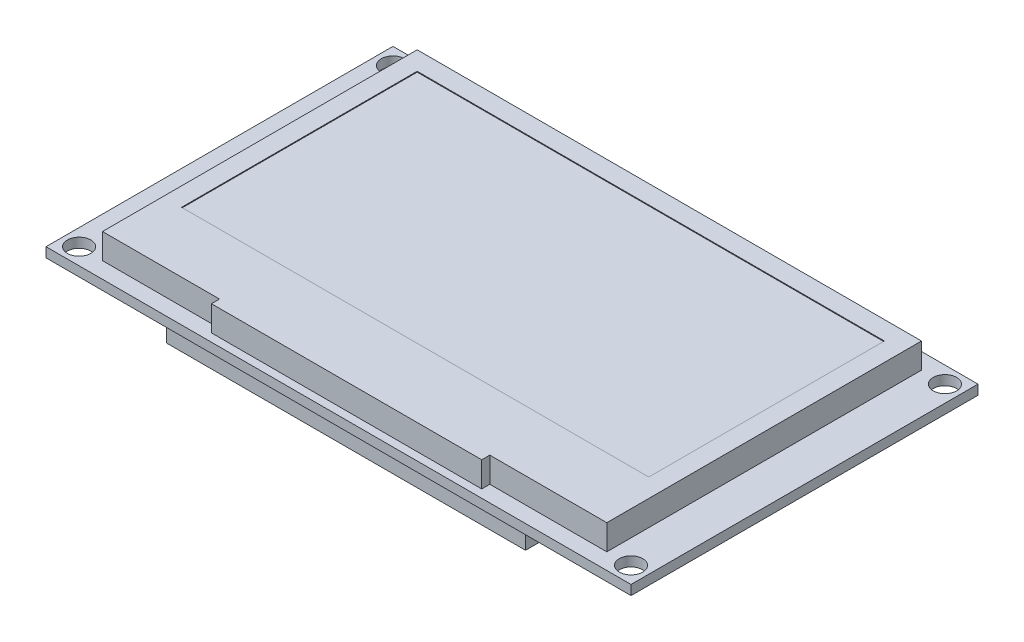
ISO-10303-21;
HEADER;
FILE_DESCRIPTION(('STEP AP214'),'2;1');
FILE_NAME('part.step','',(''),(''),'','','');
FILE_SCHEMA(('AUTOMOTIVE_DESIGN { 1 0 10303 214 1 1 1 1 }'));
ENDSEC;
DATA;
#1=APPLICATION_CONTEXT('core data for automotive mechanical design processes');
#2=APPLICATION_PROTOCOL_DEFINITION('international standard','automotive_design',2000,#1);
#3=PRODUCT_CONTEXT('',#1,'mechanical');
#4=PRODUCT('Part','Part','',(#3));
#5=PRODUCT_RELATED_PRODUCT_CATEGORY('part','',(#4));
#6=PRODUCT_DEFINITION_FORMATION('','',#4);
#7=PRODUCT_DEFINITION_CONTEXT('part definition',#1,'design');
#8=PRODUCT_DEFINITION('design','',#6,#7);
#9=PRODUCT_DEFINITION_SHAPE('','',#8);
#10=(LENGTH_UNIT() NAMED_UNIT(*) SI_UNIT(.MILLI.,.METRE.));
#11=(NAMED_UNIT(*) PLANE_ANGLE_UNIT() SI_UNIT($,.RADIAN.));
#12=(NAMED_UNIT(*) SI_UNIT($,.STERADIAN.) SOLID_ANGLE_UNIT());
#13=UNCERTAINTY_MEASURE_WITH_UNIT(LENGTH_MEASURE(1.E-05),#10,'distance_accuracy_value','');
#14=(GEOMETRIC_REPRESENTATION_CONTEXT(3) GLOBAL_UNCERTAINTY_ASSIGNED_CONTEXT((#13)) GLOBAL_UNIT_ASSIGNED_CONTEXT((#10,
#11,#12)) REPRESENTATION_CONTEXT('',''));
#15=CARTESIAN_POINT('',(0.,0.,0.));
#16=DIRECTION('',(0.,0.,1.));
#17=DIRECTION('',(1.,0.,0.));
#18=AXIS2_PLACEMENT_3D('',#15,#16,#17);
#19=CARTESIAN_POINT('',(0.,0.,0.));
#20=DIRECTION('',(0.,-1.,0.));
#21=DIRECTION('',(0.,0.,-1.));
#22=AXIS2_PLACEMENT_3D('',#19,#20,#21);
#23=PLANE('',#22);
#24=DIRECTION('',(0.,0.,-1.));
#25=VECTOR('',#24,1.);
#26=CARTESIAN_POINT('',(36.25,0.,21.5));
#27=LINE('',#26,#25);
#28=CARTESIAN_POINT('',(36.25,0.,21.5));
#29=VERTEX_POINT('',#28);
#30=CARTESIAN_POINT('',(36.25,0.,-21.5));
#31=VERTEX_POINT('',#30);
#32=EDGE_CURVE('E366',#29,#31,#27,.T.);
#33=ORIENTED_EDGE('',*,*,#32,.T.);
#34=DIRECTION('',(-1.,0.,0.));
#35=VECTOR('',#34,1.);
#36=CARTESIAN_POINT('',(-36.25,0.,-21.5));
#37=LINE('',#36,#35);
#38=CARTESIAN_POINT('',(-36.25,0.,-21.5));
#39=VERTEX_POINT('',#38);
#40=EDGE_CURVE('E384',#31,#39,#37,.T.);
#41=ORIENTED_EDGE('',*,*,#40,.T.);
#42=DIRECTION('',(0.,0.,1.));
#43=VECTOR('',#42,1.);
#44=CARTESIAN_POINT('',(-36.25,0.,21.5));
#45=LINE('',#44,#43);
#46=CARTESIAN_POINT('',(-36.25,0.,21.5));
#47=VERTEX_POINT('',#46);
#48=EDGE_CURVE('E387',#39,#47,#45,.T.);
#49=ORIENTED_EDGE('',*,*,#48,.T.);
#50=DIRECTION('',(1.,0.,0.));
#51=VECTOR('',#50,1.);
#52=CARTESIAN_POINT('',(-36.25,0.,21.5));
#53=LINE('',#52,#51);
#54=EDGE_CURVE('E373',#47,#29,#53,.T.);
#55=ORIENTED_EDGE('',*,*,#54,.T.);
#56=EDGE_LOOP('',(#33,#41,#49,#55));
#57=FACE_BOUND('',#56,.T.);
#58=CARTESIAN_POINT('',(-34.2,0.,-19.45));
#59=DIRECTION('',(0.,1.,0.));
#60=DIRECTION('',(0.,0.,1.));
#61=AXIS2_PLACEMENT_3D('',#58,#59,#60);
#62=CIRCLE('',#61,1.45);
#63=CARTESIAN_POINT('',(-34.2,0.,-18.));
#64=VERTEX_POINT('',#63);
#65=EDGE_CURVE('E360',#64,#64,#62,.T.);
#66=ORIENTED_EDGE('',*,*,#65,.F.);
#67=EDGE_LOOP('',(#66));
#68=FACE_BOUND('',#67,.T.);
#69=CARTESIAN_POINT('',(-33.7500000000001,0.,-7.62));
#70=DIRECTION('',(0.,1.,0.));
#71=DIRECTION('',(0.,0.,1.));
#72=AXIS2_PLACEMENT_3D('',#69,#70,#71);
#73=CIRCLE('',#72,0.499999999999999);
#74=CARTESIAN_POINT('',(-33.7500000000001,0.,-7.12));
#75=VERTEX_POINT('',#74);
#76=EDGE_CURVE('E354',#75,#75,#73,.T.);
#77=ORIENTED_EDGE('',*,*,#76,.F.);
#78=EDGE_LOOP('',(#77));
#79=FACE_BOUND('',#78,.T.);
#80=CARTESIAN_POINT('',(-33.75,0.,-5.08));
#81=DIRECTION('',(0.,1.,0.));
#82=DIRECTION('',(0.,0.,1.));
#83=AXIS2_PLACEMENT_3D('',#80,#81,#82);
#84=CIRCLE('',#83,0.499999999999999);
#85=CARTESIAN_POINT('',(-33.75,0.,-4.58));
#86=VERTEX_POINT('',#85);
#87=EDGE_CURVE('E348',#86,#86,#84,.T.);
#88=ORIENTED_EDGE('',*,*,#87,.F.);
#89=EDGE_LOOP('',(#88));
#90=FACE_BOUND('',#89,.T.);
#91=CARTESIAN_POINT('',(-33.75,0.,-2.54));
#92=DIRECTION('',(0.,1.,0.));
#93=DIRECTION('',(0.,0.,1.));
#94=AXIS2_PLACEMENT_3D('',#91,#92,#93);
#95=CIRCLE('',#94,0.499999999999999);
#96=CARTESIAN_POINT('',(-33.75,0.,-2.04));
#97=VERTEX_POINT('',#96);
#98=EDGE_CURVE('E342',#97,#97,#95,.T.);
#99=ORIENTED_EDGE('',*,*,#98,.F.);
#100=EDGE_LOOP('',(#99));
#101=FACE_BOUND('',#100,.T.);
#102=CARTESIAN_POINT('',(-33.75,0.,0.));
#103=DIRECTION('',(0.,1.,0.));
#104=DIRECTION('',(0.,0.,1.));
#105=AXIS2_PLACEMENT_3D('',#102,#103,#104);
#106=CIRCLE('',#105,0.499999999999999);
#107=CARTESIAN_POINT('',(-33.75,0.,0.499999999999999));
#108=VERTEX_POINT('',#107);
#109=EDGE_CURVE('E336',#108,#108,#106,.T.);
#110=ORIENTED_EDGE('',*,*,#109,.F.);
#111=EDGE_LOOP('',(#110));
#112=FACE_BOUND('',#111,.T.);
#113=CARTESIAN_POINT('',(-33.75,0.,2.54));
#114=DIRECTION('',(0.,1.,0.));
#115=DIRECTION('',(0.,0.,1.));
#116=AXIS2_PLACEMENT_3D('',#113,#114,#115);
#117=CIRCLE('',#116,0.499999999999999);
#118=CARTESIAN_POINT('',(-33.75,0.,3.04));
#119=VERTEX_POINT('',#118);
#120=EDGE_CURVE('E330',#119,#119,#117,.T.);
#121=ORIENTED_EDGE('',*,*,#120,.F.);
#122=EDGE_LOOP('',(#121));
#123=FACE_BOUND('',#122,.T.);
#124=CARTESIAN_POINT('',(-33.7499999999999,0.,5.08));
#125=DIRECTION('',(0.,1.,0.));
#126=DIRECTION('',(0.,0.,1.));
#127=AXIS2_PLACEMENT_3D('',#124,#125,#126);
#128=CIRCLE('',#127,0.499999999999999);
#129=CARTESIAN_POINT('',(-33.7499999999999,0.,5.58));
#130=VERTEX_POINT('',#129);
#131=EDGE_CURVE('E324',#130,#130,#128,.T.);
#132=ORIENTED_EDGE('',*,*,#131,.F.);
#133=EDGE_LOOP('',(#132));
#134=FACE_BOUND('',#133,.T.);
#135=CARTESIAN_POINT('',(-33.7499999999999,0.,7.62));
#136=DIRECTION('',(0.,1.,0.));
#137=DIRECTION('',(0.,0.,1.));
#138=AXIS2_PLACEMENT_3D('',#135,#136,#137);
#139=CIRCLE('',#138,0.499999999999999);
#140=CARTESIAN_POINT('',(-33.7499999999999,0.,8.12));
#141=VERTEX_POINT('',#140);
#142=EDGE_CURVE('E318',#141,#141,#139,.T.);
#143=ORIENTED_EDGE('',*,*,#142,.F.);
#144=EDGE_LOOP('',(#143));
#145=FACE_BOUND('',#144,.T.);
#146=CARTESIAN_POINT('',(-34.2,0.,19.45));
#147=DIRECTION('',(0.,1.,0.));
#148=DIRECTION('',(0.,0.,-1.));
#149=AXIS2_PLACEMENT_3D('',#146,#147,#148);
#150=CIRCLE('',#149,1.45);
#151=CARTESIAN_POINT('',(-34.2,0.,18.));
#152=VERTEX_POINT('',#151);
#153=EDGE_CURVE('E312',#152,#152,#150,.T.);
#154=ORIENTED_EDGE('',*,*,#153,.F.);
#155=EDGE_LOOP('',(#154));
#156=FACE_BOUND('',#155,.T.);
#157=CARTESIAN_POINT('',(34.2,0.,-19.45));
#158=DIRECTION('',(0.,1.,0.));
#159=DIRECTION('',(0.,0.,-1.));
#160=AXIS2_PLACEMENT_3D('',#157,#158,#159);
#161=CIRCLE('',#160,1.45);
#162=CARTESIAN_POINT('',(34.2,0.,-20.9));
#163=VERTEX_POINT('',#162);
#164=EDGE_CURVE('E306',#163,#163,#161,.T.);
#165=ORIENTED_EDGE('',*,*,#164,.F.);
#166=EDGE_LOOP('',(#165));
#167=FACE_BOUND('',#166,.T.);
#168=CARTESIAN_POINT('',(34.2,0.,19.45));
#169=DIRECTION('',(0.,1.,0.));
#170=DIRECTION('',(0.,0.,1.));
#171=AXIS2_PLACEMENT_3D('',#168,#169,#170);
#172=CIRCLE('',#171,1.45);
#173=CARTESIAN_POINT('',(34.2,0.,20.9));
#174=VERTEX_POINT('',#173);
#175=EDGE_CURVE('E302',#174,#174,#172,.T.);
#176=ORIENTED_EDGE('',*,*,#175,.F.);
#177=EDGE_LOOP('',(#176));
#178=FACE_BOUND('',#177,.T.);
#179=DIRECTION('',(0.,0.,-1.));
#180=VECTOR('',#179,1.);
#181=CARTESIAN_POINT('',(31.25,0.,19.5));
#182=LINE('',#181,#180);
#183=CARTESIAN_POINT('',(31.25,0.,19.5));
#184=VERTEX_POINT('',#183);
#185=CARTESIAN_POINT('',(31.25,0.,-19.5));
#186=VERTEX_POINT('',#185);
#187=EDGE_CURVE('E60',#184,#186,#182,.T.);
#188=ORIENTED_EDGE('',*,*,#187,.F.);
#189=DIRECTION('',(1.,0.,0.));
#190=VECTOR('',#189,1.);
#191=CARTESIAN_POINT('',(16.75,0.,19.5));
#192=LINE('',#191,#190);
#193=CARTESIAN_POINT('',(16.75,0.,19.5));
#194=VERTEX_POINT('',#193);
#195=EDGE_CURVE('E215',#194,#184,#192,.T.);
#196=ORIENTED_EDGE('',*,*,#195,.F.);
#197=DIRECTION('',(0.,0.,-1.));
#198=VECTOR('',#197,1.);
#199=CARTESIAN_POINT('',(16.75,0.,20.5));
#200=LINE('',#199,#198);
#201=CARTESIAN_POINT('',(16.75,0.,20.5));
#202=VERTEX_POINT('',#201);
#203=EDGE_CURVE('E246',#202,#194,#200,.T.);
#204=ORIENTED_EDGE('',*,*,#203,.F.);
#205=DIRECTION('',(1.,0.,0.));
#206=VECTOR('',#205,1.);
#207=CARTESIAN_POINT('',(-16.75,0.,20.5));
#208=LINE('',#207,#206);
#209=CARTESIAN_POINT('',(-16.75,0.,20.5));
#210=VERTEX_POINT('',#209);
#211=EDGE_CURVE('E243',#210,#202,#208,.T.);
#212=ORIENTED_EDGE('',*,*,#211,.F.);
#213=DIRECTION('',(0.,0.,1.));
#214=VECTOR('',#213,1.);
#215=CARTESIAN_POINT('',(-16.75,0.,19.5));
#216=LINE('',#215,#214);
#217=CARTESIAN_POINT('',(-16.75,0.,19.5));
#218=VERTEX_POINT('',#217);
#219=EDGE_CURVE('E240',#218,#210,#216,.T.);
#220=ORIENTED_EDGE('',*,*,#219,.F.);
#221=DIRECTION('',(1.,0.,0.));
#222=VECTOR('',#221,1.);
#223=CARTESIAN_POINT('',(-31.25,0.,19.5));
#224=LINE('',#223,#222);
#225=CARTESIAN_POINT('',(-31.25,0.,19.5));
#226=VERTEX_POINT('',#225);
#227=EDGE_CURVE('E237',#226,#218,#224,.T.);
#228=ORIENTED_EDGE('',*,*,#227,.F.);
#229=DIRECTION('',(0.,0.,1.));
#230=VECTOR('',#229,1.);
#231=CARTESIAN_POINT('',(-31.25,0.,19.5));
#232=LINE('',#231,#230);
#233=CARTESIAN_POINT('',(-31.25,0.,-19.5));
#234=VERTEX_POINT('',#233);
#235=EDGE_CURVE('E234',#234,#226,#232,.T.);
#236=ORIENTED_EDGE('',*,*,#235,.F.);
#237=DIRECTION('',(-1.,0.,0.));
#238=VECTOR('',#237,1.);
#239=CARTESIAN_POINT('',(-31.25,0.,-19.5));
#240=LINE('',#239,#238);
#241=EDGE_CURVE('E231',#186,#234,#240,.T.);
#242=ORIENTED_EDGE('',*,*,#241,.F.);
#243=EDGE_LOOP('',(#188,#196,#204,#212,#220,#228,#236,#242));
#244=FACE_BOUND('',#243,.T.);
#245=ADVANCED_FACE('F35',(#57,#68,#79,#90,#101,#112,#123,#134,#145,#156,#167,#178,#244),#23,.F.);
#246=CARTESIAN_POINT('',(0.,-1.2,0.));
#247=DIRECTION('',(0.,-1.,0.));
#248=DIRECTION('',(0.,0.,-1.));
#249=AXIS2_PLACEMENT_3D('',#246,#247,#248);
#250=PLANE('',#249);
#251=CARTESIAN_POINT('',(34.2,-1.2,19.45));
#252=DIRECTION('',(0.,1.,0.));
#253=DIRECTION('',(0.,0.,1.));
#254=AXIS2_PLACEMENT_3D('',#251,#252,#253);
#255=CIRCLE('',#254,1.45);
#256=CARTESIAN_POINT('',(34.2,-1.2,20.9));
#257=VERTEX_POINT('',#256);
#258=EDGE_CURVE('E303',#257,#257,#255,.T.);
#259=ORIENTED_EDGE('',*,*,#258,.T.);
#260=EDGE_LOOP('',(#259));
#261=FACE_BOUND('',#260,.T.);
#262=CARTESIAN_POINT('',(34.2,-1.2,-19.45));
#263=DIRECTION('',(0.,1.,0.));
#264=DIRECTION('',(0.,0.,-1.));
#265=AXIS2_PLACEMENT_3D('',#262,#263,#264);
#266=CIRCLE('',#265,1.45);
#267=CARTESIAN_POINT('',(34.2,-1.2,-20.9));
#268=VERTEX_POINT('',#267);
#269=EDGE_CURVE('E309',#268,#268,#266,.T.);
#270=ORIENTED_EDGE('',*,*,#269,.T.);
#271=EDGE_LOOP('',(#270));
#272=FACE_BOUND('',#271,.T.);
#273=CARTESIAN_POINT('',(-34.2,-1.2,19.45));
#274=DIRECTION('',(0.,1.,0.));
#275=DIRECTION('',(0.,0.,-1.));
#276=AXIS2_PLACEMENT_3D('',#273,#274,#275);
#277=CIRCLE('',#276,1.45);
#278=CARTESIAN_POINT('',(-34.2,-1.2,18.));
#279=VERTEX_POINT('',#278);
#280=EDGE_CURVE('E315',#279,#279,#277,.T.);
#281=ORIENTED_EDGE('',*,*,#280,.T.);
#282=EDGE_LOOP('',(#281));
#283=FACE_BOUND('',#282,.T.);
#284=CARTESIAN_POINT('',(-33.7499999999999,-1.2,7.62));
#285=DIRECTION('',(0.,1.,0.));
#286=DIRECTION('',(0.,0.,1.));
#287=AXIS2_PLACEMENT_3D('',#284,#285,#286);
#288=CIRCLE('',#287,0.499999999999999);
#289=CARTESIAN_POINT('',(-33.7499999999999,-1.2,8.12));
#290=VERTEX_POINT('',#289);
#291=EDGE_CURVE('E321',#290,#290,#288,.T.);
#292=ORIENTED_EDGE('',*,*,#291,.T.);
#293=EDGE_LOOP('',(#292));
#294=FACE_BOUND('',#293,.T.);
#295=CARTESIAN_POINT('',(-33.7499999999999,-1.2,5.08));
#296=DIRECTION('',(0.,1.,0.));
#297=DIRECTION('',(0.,0.,1.));
#298=AXIS2_PLACEMENT_3D('',#295,#296,#297);
#299=CIRCLE('',#298,0.499999999999999);
#300=CARTESIAN_POINT('',(-33.7499999999999,-1.2,5.58));
#301=VERTEX_POINT('',#300);
#302=EDGE_CURVE('E327',#301,#301,#299,.T.);
#303=ORIENTED_EDGE('',*,*,#302,.T.);
#304=EDGE_LOOP('',(#303));
#305=FACE_BOUND('',#304,.T.);
#306=CARTESIAN_POINT('',(-33.75,-1.2,2.54));
#307=DIRECTION('',(0.,1.,0.));
#308=DIRECTION('',(0.,0.,1.));
#309=AXIS2_PLACEMENT_3D('',#306,#307,#308);
#310=CIRCLE('',#309,0.499999999999999);
#311=CARTESIAN_POINT('',(-33.75,-1.2,3.04));
#312=VERTEX_POINT('',#311);
#313=EDGE_CURVE('E333',#312,#312,#310,.T.);
#314=ORIENTED_EDGE('',*,*,#313,.T.);
#315=EDGE_LOOP('',(#314));
#316=FACE_BOUND('',#315,.T.);
#317=CARTESIAN_POINT('',(-33.75,-1.2,0.));
#318=DIRECTION('',(0.,1.,0.));
#319=DIRECTION('',(0.,0.,1.));
#320=AXIS2_PLACEMENT_3D('',#317,#318,#319);
#321=CIRCLE('',#320,0.499999999999999);
#322=CARTESIAN_POINT('',(-33.75,-1.2,0.499999999999999));
#323=VERTEX_POINT('',#322);
#324=EDGE_CURVE('E339',#323,#323,#321,.T.);
#325=ORIENTED_EDGE('',*,*,#324,.T.);
#326=EDGE_LOOP('',(#325));
#327=FACE_BOUND('',#326,.T.);
#328=CARTESIAN_POINT('',(-33.75,-1.2,-2.54));
#329=DIRECTION('',(0.,1.,0.));
#330=DIRECTION('',(0.,0.,1.));
#331=AXIS2_PLACEMENT_3D('',#328,#329,#330);
#332=CIRCLE('',#331,0.499999999999999);
#333=CARTESIAN_POINT('',(-33.75,-1.2,-2.04));
#334=VERTEX_POINT('',#333);
#335=EDGE_CURVE('E345',#334,#334,#332,.T.);
#336=ORIENTED_EDGE('',*,*,#335,.T.);
#337=EDGE_LOOP('',(#336));
#338=FACE_BOUND('',#337,.T.);
#339=CARTESIAN_POINT('',(-33.75,-1.2,-5.08));
#340=DIRECTION('',(0.,1.,0.));
#341=DIRECTION('',(0.,0.,1.));
#342=AXIS2_PLACEMENT_3D('',#339,#340,#341);
#343=CIRCLE('',#342,0.499999999999999);
#344=CARTESIAN_POINT('',(-33.75,-1.2,-4.58));
#345=VERTEX_POINT('',#344);
#346=EDGE_CURVE('E351',#345,#345,#343,.T.);
#347=ORIENTED_EDGE('',*,*,#346,.T.);
#348=EDGE_LOOP('',(#347));
#349=FACE_BOUND('',#348,.T.);
#350=CARTESIAN_POINT('',(-33.7500000000001,-1.2,-7.62));
#351=DIRECTION('',(0.,1.,0.));
#352=DIRECTION('',(0.,0.,1.));
#353=AXIS2_PLACEMENT_3D('',#350,#351,#352);
#354=CIRCLE('',#353,0.499999999999999);
#355=CARTESIAN_POINT('',(-33.7500000000001,-1.2,-7.12));
#356=VERTEX_POINT('',#355);
#357=EDGE_CURVE('E357',#356,#356,#354,.T.);
#358=ORIENTED_EDGE('',*,*,#357,.T.);
#359=EDGE_LOOP('',(#358));
#360=FACE_BOUND('',#359,.T.);
#361=CARTESIAN_POINT('',(-34.2,-1.2,-19.45));
#362=DIRECTION('',(0.,1.,0.));
#363=DIRECTION('',(0.,0.,1.));
#364=AXIS2_PLACEMENT_3D('',#361,#362,#363);
#365=CIRCLE('',#364,1.45);
#366=CARTESIAN_POINT('',(-34.2,-1.2,-18.));
#367=VERTEX_POINT('',#366);
#368=EDGE_CURVE('E363',#367,#367,#365,.T.);
#369=ORIENTED_EDGE('',*,*,#368,.T.);
#370=EDGE_LOOP('',(#369));
#371=FACE_BOUND('',#370,.T.);
#372=DIRECTION('',(0.,0.,-1.));
#373=VECTOR('',#372,1.);
#374=CARTESIAN_POINT('',(36.25,-1.2,21.5));
#375=LINE('',#374,#373);
#376=CARTESIAN_POINT('',(36.25,-1.2,21.5));
#377=VERTEX_POINT('',#376);
#378=CARTESIAN_POINT('',(36.25,-1.2,-21.5));
#379=VERTEX_POINT('',#378);
#380=EDGE_CURVE('E369',#377,#379,#375,.T.);
#381=ORIENTED_EDGE('',*,*,#380,.F.);
#382=DIRECTION('',(1.,0.,0.));
#383=VECTOR('',#382,1.);
#384=CARTESIAN_POINT('',(-36.25,-1.2,21.5));
#385=LINE('',#384,#383);
#386=CARTESIAN_POINT('',(-36.25,-1.2,21.5));
#387=VERTEX_POINT('',#386);
#388=EDGE_CURVE('E379',#387,#377,#385,.T.);
#389=ORIENTED_EDGE('',*,*,#388,.F.);
#390=DIRECTION('',(0.,0.,1.));
#391=VECTOR('',#390,1.);
#392=CARTESIAN_POINT('',(-36.25,-1.2,21.5));
#393=LINE('',#392,#391);
#394=CARTESIAN_POINT('',(-36.25,-1.2,-21.5));
#395=VERTEX_POINT('',#394);
#396=EDGE_CURVE('E376',#395,#387,#393,.T.);
#397=ORIENTED_EDGE('',*,*,#396,.F.);
#398=DIRECTION('',(-1.,0.,0.));
#399=VECTOR('',#398,1.);
#400=CARTESIAN_POINT('',(-36.25,-1.2,-21.5));
#401=LINE('',#400,#399);
#402=EDGE_CURVE('E372',#379,#395,#401,.T.);
#403=ORIENTED_EDGE('',*,*,#402,.F.);
#404=EDGE_LOOP('',(#381,#389,#397,#403));
#405=FACE_BOUND('',#404,.T.);
#406=DIRECTION('',(-1.,0.,0.));
#407=VECTOR('',#406,1.);
#408=CARTESIAN_POINT('',(-22.25,-1.2,20.5730095070977));
#409=LINE('',#408,#407);
#410=CARTESIAN_POINT('',(22.25,-1.2,20.5730095070977));
#411=VERTEX_POINT('',#410);
#412=CARTESIAN_POINT('',(-22.25,-1.2,20.5730095070977));
#413=VERTEX_POINT('',#412);
#414=EDGE_CURVE('E287',#411,#413,#409,.T.);
#415=ORIENTED_EDGE('',*,*,#414,.F.);
#416=DIRECTION('',(0.,0.,1.));
#417=VECTOR('',#416,1.);
#418=CARTESIAN_POINT('',(22.25,-1.2,-20.5730095070977));
#419=LINE('',#418,#417);
#420=CARTESIAN_POINT('',(22.25,-1.2,-20.5730095070977));
#421=VERTEX_POINT('',#420);
#422=EDGE_CURVE('E273',#421,#411,#419,.T.);
#423=ORIENTED_EDGE('',*,*,#422,.F.);
#424=DIRECTION('',(1.,0.,0.));
#425=VECTOR('',#424,1.);
#426=CARTESIAN_POINT('',(-22.25,-1.2,-20.5730095070977));
#427=LINE('',#426,#425);
#428=CARTESIAN_POINT('',(-22.25,-1.2,-20.5730095070977));
#429=VERTEX_POINT('',#428);
#430=EDGE_CURVE('E278',#429,#421,#427,.T.);
#431=ORIENTED_EDGE('',*,*,#430,.F.);
#432=DIRECTION('',(0.,0.,-1.));
#433=VECTOR('',#432,1.);
#434=CARTESIAN_POINT('',(-22.25,-1.2,-20.5730095070977));
#435=LINE('',#434,#433);
#436=EDGE_CURVE('E289',#413,#429,#435,.T.);
#437=ORIENTED_EDGE('',*,*,#436,.F.);
#438=EDGE_LOOP('',(#415,#423,#431,#437));
#439=FACE_BOUND('',#438,.T.);
#440=ADVANCED_FACE('F408',(#261,#272,#283,#294,#305,#316,#327,#338,#349,#360,#371,#405,#439),
#250,.T.);
#441=CARTESIAN_POINT('',(36.25,-1.2,21.5));
#442=DIRECTION('',(1.,0.,0.));
#443=DIRECTION('',(0.,0.,-1.));
#444=AXIS2_PLACEMENT_3D('',#441,#442,#443);
#445=PLANE('',#444);
#446=ORIENTED_EDGE('',*,*,#32,.F.);
#447=DIRECTION('',(0.,1.,0.));
#448=VECTOR('',#447,1.);
#449=CARTESIAN_POINT('',(36.25,-1.2,21.5));
#450=LINE('',#449,#448);
#451=EDGE_CURVE('E11',#377,#29,#450,.T.);
#452=ORIENTED_EDGE('',*,*,#451,.F.);
#453=ORIENTED_EDGE('',*,*,#380,.T.);
#454=DIRECTION('',(0.,1.,0.));
#455=VECTOR('',#454,1.);
#456=CARTESIAN_POINT('',(36.25,-1.2,-21.5));
#457=LINE('',#456,#455);
#458=EDGE_CURVE('E39',#379,#31,#457,.T.);
#459=ORIENTED_EDGE('',*,*,#458,.T.);
#460=EDGE_LOOP('',(#446,#452,#453,#459));
#461=FACE_BOUND('',#460,.T.);
#462=ADVANCED_FACE('F37',(#461),#445,.T.);
#463=CARTESIAN_POINT('',(-36.25,-1.2,21.5));
#464=DIRECTION('',(0.,0.,1.));
#465=DIRECTION('',(1.,0.,0.));
#466=AXIS2_PLACEMENT_3D('',#463,#464,#465);
#467=PLANE('',#466);
#468=ORIENTED_EDGE('',*,*,#54,.F.);
#469=DIRECTION('',(0.,1.,0.));
#470=VECTOR('',#469,1.);
#471=CARTESIAN_POINT('',(-36.25,-1.2,21.5));
#472=LINE('',#471,#470);
#473=EDGE_CURVE('E44',#387,#47,#472,.T.);
#474=ORIENTED_EDGE('',*,*,#473,.F.);
#475=ORIENTED_EDGE('',*,*,#388,.T.);
#476=ORIENTED_EDGE('',*,*,#451,.T.);
#477=EDGE_LOOP('',(#468,#474,#475,#476));
#478=FACE_BOUND('',#477,.T.);
#479=ADVANCED_FACE('F405',(#478),#467,.T.);
#480=CARTESIAN_POINT('',(-36.25,-1.2,21.5));
#481=DIRECTION('',(-1.,0.,0.));
#482=DIRECTION('',(0.,0.,1.));
#483=AXIS2_PLACEMENT_3D('',#480,#481,#482);
#484=PLANE('',#483);
#485=ORIENTED_EDGE('',*,*,#48,.F.);
#486=DIRECTION('',(0.,1.,0.));
#487=VECTOR('',#486,1.);
#488=CARTESIAN_POINT('',(-36.25,-1.2,-21.5));
#489=LINE('',#488,#487);
#490=EDGE_CURVE('E392',#395,#39,#489,.T.);
#491=ORIENTED_EDGE('',*,*,#490,.F.);
#492=ORIENTED_EDGE('',*,*,#396,.T.);
#493=ORIENTED_EDGE('',*,*,#473,.T.);
#494=EDGE_LOOP('',(#485,#491,#492,#493));
#495=FACE_BOUND('',#494,.T.);
#496=ADVANCED_FACE('F412',(#495),#484,.T.);
#497=CARTESIAN_POINT('',(-36.25,-1.2,-21.5));
#498=DIRECTION('',(0.,0.,-1.));
#499=DIRECTION('',(-1.,0.,0.));
#500=AXIS2_PLACEMENT_3D('',#497,#498,#499);
#501=PLANE('',#500);
#502=ORIENTED_EDGE('',*,*,#40,.F.);
#503=ORIENTED_EDGE('',*,*,#458,.F.);
#504=ORIENTED_EDGE('',*,*,#402,.T.);
#505=ORIENTED_EDGE('',*,*,#490,.T.);
#506=EDGE_LOOP('',(#502,#503,#504,#505));
#507=FACE_BOUND('',#506,.T.);
#508=ADVANCED_FACE('F400',(#507),#501,.T.);
#509=CARTESIAN_POINT('',(-34.2,-1.2,-19.45));
#510=DIRECTION('',(0.,1.,0.));
#511=DIRECTION('',(0.,0.,1.));
#512=AXIS2_PLACEMENT_3D('',#509,#510,#511);
#513=CYLINDRICAL_SURFACE('',#512,1.45);
#514=ORIENTED_EDGE('',*,*,#368,.F.);
#515=EDGE_LOOP('',(#514));
#516=FACE_BOUND('',#515,.T.);
#517=ORIENTED_EDGE('',*,*,#65,.T.);
#518=EDGE_LOOP('',(#517));
#519=FACE_BOUND('',#518,.T.);
#520=ADVANCED_FACE('F419',(#516,#519),#513,.F.);
#521=CARTESIAN_POINT('',(-33.7500000000001,-1.2,-7.62));
#522=DIRECTION('',(0.,1.,0.));
#523=DIRECTION('',(0.,0.,1.));
#524=AXIS2_PLACEMENT_3D('',#521,#522,#523);
#525=CYLINDRICAL_SURFACE('',#524,0.499999999999999);
#526=ORIENTED_EDGE('',*,*,#357,.F.);
#527=EDGE_LOOP('',(#526));
#528=FACE_BOUND('',#527,.T.);
#529=ORIENTED_EDGE('',*,*,#76,.T.);
#530=EDGE_LOOP('',(#529));
#531=FACE_BOUND('',#530,.T.);
#532=ADVANCED_FACE('F431',(#528,#531),#525,.F.);
#533=CARTESIAN_POINT('',(-33.75,-1.2,-5.08));
#534=DIRECTION('',(0.,1.,0.));
#535=DIRECTION('',(0.,0.,1.));
#536=AXIS2_PLACEMENT_3D('',#533,#534,#535);
#537=CYLINDRICAL_SURFACE('',#536,0.499999999999999);
#538=ORIENTED_EDGE('',*,*,#346,.F.);
#539=EDGE_LOOP('',(#538));
#540=FACE_BOUND('',#539,.T.);
#541=ORIENTED_EDGE('',*,*,#87,.T.);
#542=EDGE_LOOP('',(#541));
#543=FACE_BOUND('',#542,.T.);
#544=ADVANCED_FACE('F435',(#540,#543),#537,.F.);
#545=CARTESIAN_POINT('',(-33.75,-1.2,-2.54));
#546=DIRECTION('',(0.,1.,0.));
#547=DIRECTION('',(0.,0.,1.));
#548=AXIS2_PLACEMENT_3D('',#545,#546,#547);
#549=CYLINDRICAL_SURFACE('',#548,0.499999999999999);
#550=ORIENTED_EDGE('',*,*,#335,.F.);
#551=EDGE_LOOP('',(#550));
#552=FACE_BOUND('',#551,.T.);
#553=ORIENTED_EDGE('',*,*,#98,.T.);
#554=EDGE_LOOP('',(#553));
#555=FACE_BOUND('',#554,.T.);
#556=ADVANCED_FACE('F439',(#552,#555),#549,.F.);
#557=CARTESIAN_POINT('',(-33.75,-1.2,0.));
#558=DIRECTION('',(0.,1.,0.));
#559=DIRECTION('',(0.,0.,1.));
#560=AXIS2_PLACEMENT_3D('',#557,#558,#559);
#561=CYLINDRICAL_SURFACE('',#560,0.499999999999999);
#562=ORIENTED_EDGE('',*,*,#324,.F.);
#563=EDGE_LOOP('',(#562));
#564=FACE_BOUND('',#563,.T.);
#565=ORIENTED_EDGE('',*,*,#109,.T.);
#566=EDGE_LOOP('',(#565));
#567=FACE_BOUND('',#566,.T.);
#568=ADVANCED_FACE('F443',(#564,#567),#561,.F.);
#569=CARTESIAN_POINT('',(-33.75,-1.2,2.54));
#570=DIRECTION('',(0.,1.,0.));
#571=DIRECTION('',(0.,0.,1.));
#572=AXIS2_PLACEMENT_3D('',#569,#570,#571);
#573=CYLINDRICAL_SURFACE('',#572,0.499999999999999);
#574=ORIENTED_EDGE('',*,*,#313,.F.);
#575=EDGE_LOOP('',(#574));
#576=FACE_BOUND('',#575,.T.);
#577=ORIENTED_EDGE('',*,*,#120,.T.);
#578=EDGE_LOOP('',(#577));
#579=FACE_BOUND('',#578,.T.);
#580=ADVANCED_FACE('F447',(#576,#579),#573,.F.);
#581=CARTESIAN_POINT('',(-33.7499999999999,-1.2,5.08));
#582=DIRECTION('',(0.,1.,0.));
#583=DIRECTION('',(0.,0.,1.));
#584=AXIS2_PLACEMENT_3D('',#581,#582,#583);
#585=CYLINDRICAL_SURFACE('',#584,0.499999999999999);
#586=ORIENTED_EDGE('',*,*,#302,.F.);
#587=EDGE_LOOP('',(#586));
#588=FACE_BOUND('',#587,.T.);
#589=ORIENTED_EDGE('',*,*,#131,.T.);
#590=EDGE_LOOP('',(#589));
#591=FACE_BOUND('',#590,.T.);
#592=ADVANCED_FACE('F451',(#588,#591),#585,.F.);
#593=CARTESIAN_POINT('',(-33.7499999999999,-1.2,7.62));
#594=DIRECTION('',(0.,1.,0.));
#595=DIRECTION('',(0.,0.,1.));
#596=AXIS2_PLACEMENT_3D('',#593,#594,#595);
#597=CYLINDRICAL_SURFACE('',#596,0.499999999999999);
#598=ORIENTED_EDGE('',*,*,#291,.F.);
#599=EDGE_LOOP('',(#598));
#600=FACE_BOUND('',#599,.T.);
#601=ORIENTED_EDGE('',*,*,#142,.T.);
#602=EDGE_LOOP('',(#601));
#603=FACE_BOUND('',#602,.T.);
#604=ADVANCED_FACE('F455',(#600,#603),#597,.F.);
#605=CARTESIAN_POINT('',(-34.2,-1.2,19.45));
#606=DIRECTION('',(0.,1.,0.));
#607=DIRECTION('',(0.,0.,1.));
#608=AXIS2_PLACEMENT_3D('',#605,#606,#607);
#609=CYLINDRICAL_SURFACE('',#608,1.45);
#610=ORIENTED_EDGE('',*,*,#280,.F.);
#611=EDGE_LOOP('',(#610));
#612=FACE_BOUND('',#611,.T.);
#613=ORIENTED_EDGE('',*,*,#153,.T.);
#614=EDGE_LOOP('',(#613));
#615=FACE_BOUND('',#614,.T.);
#616=ADVANCED_FACE('F459',(#612,#615),#609,.F.);
#617=CARTESIAN_POINT('',(34.2,-1.2,-19.45));
#618=DIRECTION('',(0.,1.,0.));
#619=DIRECTION('',(0.,0.,1.));
#620=AXIS2_PLACEMENT_3D('',#617,#618,#619);
#621=CYLINDRICAL_SURFACE('',#620,1.45);
#622=ORIENTED_EDGE('',*,*,#269,.F.);
#623=EDGE_LOOP('',(#622));
#624=FACE_BOUND('',#623,.T.);
#625=ORIENTED_EDGE('',*,*,#164,.T.);
#626=EDGE_LOOP('',(#625));
#627=FACE_BOUND('',#626,.T.);
#628=ADVANCED_FACE('F463',(#624,#627),#621,.F.);
#629=CARTESIAN_POINT('',(34.2,-1.2,19.45));
#630=DIRECTION('',(0.,1.,0.));
#631=DIRECTION('',(0.,0.,1.));
#632=AXIS2_PLACEMENT_3D('',#629,#630,#631);
#633=CYLINDRICAL_SURFACE('',#632,1.45);
#634=ORIENTED_EDGE('',*,*,#258,.F.);
#635=EDGE_LOOP('',(#634));
#636=FACE_BOUND('',#635,.T.);
#637=ORIENTED_EDGE('',*,*,#175,.T.);
#638=EDGE_LOOP('',(#637));
#639=FACE_BOUND('',#638,.T.);
#640=ADVANCED_FACE('F467',(#636,#639),#633,.F.);
#641=CARTESIAN_POINT('',(22.25,-3.8,-20.5730095070977));
#642=DIRECTION('',(-1.,0.,0.));
#643=DIRECTION('',(0.,0.,1.));
#644=AXIS2_PLACEMENT_3D('',#641,#642,#643);
#645=PLANE('',#644);
#646=ORIENTED_EDGE('',*,*,#422,.T.);
#647=DIRECTION('',(0.,1.,0.));
#648=VECTOR('',#647,1.);
#649=CARTESIAN_POINT('',(22.25,-3.8,20.5730095070977));
#650=LINE('',#649,#648);
#651=CARTESIAN_POINT('',(22.25,-3.8,20.5730095070977));
#652=VERTEX_POINT('',#651);
#653=EDGE_CURVE('E300',#652,#411,#650,.T.);
#654=ORIENTED_EDGE('',*,*,#653,.F.);
#655=DIRECTION('',(0.,0.,1.));
#656=VECTOR('',#655,1.);
#657=CARTESIAN_POINT('',(22.25,-3.8,-20.5730095070977));
#658=LINE('',#657,#656);
#659=CARTESIAN_POINT('',(22.25,-3.8,-20.5730095070977));
#660=VERTEX_POINT('',#659);
#661=EDGE_CURVE('E274',#660,#652,#658,.T.);
#662=ORIENTED_EDGE('',*,*,#661,.F.);
#663=DIRECTION('',(0.,1.,0.));
#664=VECTOR('',#663,1.);
#665=CARTESIAN_POINT('',(22.25,-3.8,-20.5730095070977));
#666=LINE('',#665,#664);
#667=EDGE_CURVE('E284',#660,#421,#666,.T.);
#668=ORIENTED_EDGE('',*,*,#667,.T.);
#669=EDGE_LOOP('',(#646,#654,#662,#668));
#670=FACE_BOUND('',#669,.T.);
#671=ADVANCED_FACE('F471',(#670),#645,.F.);
#672=CARTESIAN_POINT('',(-22.25,-3.8,20.5730095070977));
#673=DIRECTION('',(0.,0.,-1.));
#674=DIRECTION('',(-1.,0.,0.));
#675=AXIS2_PLACEMENT_3D('',#672,#673,#674);
#676=PLANE('',#675);
#677=ORIENTED_EDGE('',*,*,#414,.T.);
#678=DIRECTION('',(0.,1.,0.));
#679=VECTOR('',#678,1.);
#680=CARTESIAN_POINT('',(-22.25,-3.8,20.5730095070977));
#681=LINE('',#680,#679);
#682=CARTESIAN_POINT('',(-22.25,-3.8,20.5730095070977));
#683=VERTEX_POINT('',#682);
#684=EDGE_CURVE('E297',#683,#413,#681,.T.);
#685=ORIENTED_EDGE('',*,*,#684,.F.);
#686=DIRECTION('',(-1.,0.,0.));
#687=VECTOR('',#686,1.);
#688=CARTESIAN_POINT('',(-22.25,-3.8,20.5730095070977));
#689=LINE('',#688,#687);
#690=EDGE_CURVE('E277',#652,#683,#689,.T.);
#691=ORIENTED_EDGE('',*,*,#690,.F.);
#692=ORIENTED_EDGE('',*,*,#653,.T.);
#693=EDGE_LOOP('',(#677,#685,#691,#692));
#694=FACE_BOUND('',#693,.T.);
#695=ADVANCED_FACE('F475',(#694),#676,.F.);
#696=CARTESIAN_POINT('',(-22.25,-3.8,-20.5730095070977));
#697=DIRECTION('',(1.,0.,0.));
#698=DIRECTION('',(0.,0.,-1.));
#699=AXIS2_PLACEMENT_3D('',#696,#697,#698);
#700=PLANE('',#699);
#701=ORIENTED_EDGE('',*,*,#436,.T.);
#702=DIRECTION('',(0.,1.,0.));
#703=VECTOR('',#702,1.);
#704=CARTESIAN_POINT('',(-22.25,-3.8,-20.5730095070977));
#705=LINE('',#704,#703);
#706=CARTESIAN_POINT('',(-22.25,-3.8,-20.5730095070977));
#707=VERTEX_POINT('',#706);
#708=EDGE_CURVE('E295',#707,#429,#705,.T.);
#709=ORIENTED_EDGE('',*,*,#708,.F.);
#710=DIRECTION('',(0.,0.,-1.));
#711=VECTOR('',#710,1.);
#712=CARTESIAN_POINT('',(-22.25,-3.8,-20.5730095070977));
#713=LINE('',#712,#711);
#714=EDGE_CURVE('E280',#683,#707,#713,.T.);
#715=ORIENTED_EDGE('',*,*,#714,.F.);
#716=ORIENTED_EDGE('',*,*,#684,.T.);
#717=EDGE_LOOP('',(#701,#709,#715,#716));
#718=FACE_BOUND('',#717,.T.);
#719=ADVANCED_FACE('F479',(#718),#700,.F.);
#720=CARTESIAN_POINT('',(-22.25,-3.8,-20.5730095070977));
#721=DIRECTION('',(0.,0.,1.));
#722=DIRECTION('',(1.,0.,0.));
#723=AXIS2_PLACEMENT_3D('',#720,#721,#722);
#724=PLANE('',#723);
#725=ORIENTED_EDGE('',*,*,#430,.T.);
#726=ORIENTED_EDGE('',*,*,#667,.F.);
#727=DIRECTION('',(1.,0.,0.));
#728=VECTOR('',#727,1.);
#729=CARTESIAN_POINT('',(-22.25,-3.8,-20.5730095070977));
#730=LINE('',#729,#728);
#731=EDGE_CURVE('E282',#707,#660,#730,.T.);
#732=ORIENTED_EDGE('',*,*,#731,.F.);
#733=ORIENTED_EDGE('',*,*,#708,.T.);
#734=EDGE_LOOP('',(#725,#726,#732,#733));
#735=FACE_BOUND('',#734,.T.);
#736=ADVANCED_FACE('F483',(#735),#724,.F.);
#737=CARTESIAN_POINT('',(0.,-3.8,0.));
#738=DIRECTION('',(0.,1.,0.));
#739=DIRECTION('',(0.,0.,1.));
#740=AXIS2_PLACEMENT_3D('',#737,#738,#739);
#741=PLANE('',#740);
#742=ORIENTED_EDGE('',*,*,#661,.T.);
#743=ORIENTED_EDGE('',*,*,#690,.T.);
#744=ORIENTED_EDGE('',*,*,#714,.T.);
#745=ORIENTED_EDGE('',*,*,#731,.T.);
#746=EDGE_LOOP('',(#742,#743,#744,#745));
#747=FACE_BOUND('',#746,.T.);
#748=ADVANCED_FACE('F487',(#747),#741,.F.);
#749=CARTESIAN_POINT('',(31.25,3.13,19.5));
#750=DIRECTION('',(-1.,0.,0.));
#751=DIRECTION('',(0.,0.,1.));
#752=AXIS2_PLACEMENT_3D('',#749,#750,#751);
#753=PLANE('',#752);
#754=ORIENTED_EDGE('',*,*,#187,.T.);
#755=DIRECTION('',(0.,-1.,0.));
#756=VECTOR('',#755,1.);
#757=CARTESIAN_POINT('',(31.25,3.13,-19.5));
#758=LINE('',#757,#756);
#759=CARTESIAN_POINT('',(31.25,3.13,-19.5));
#760=VERTEX_POINT('',#759);
#761=EDGE_CURVE('E270',#760,#186,#758,.T.);
#762=ORIENTED_EDGE('',*,*,#761,.F.);
#763=DIRECTION('',(0.,0.,-1.));
#764=VECTOR('',#763,1.);
#765=CARTESIAN_POINT('',(31.25,3.13,19.5));
#766=LINE('',#765,#764);
#767=CARTESIAN_POINT('',(31.25,3.13,19.5));
#768=VERTEX_POINT('',#767);
#769=EDGE_CURVE('E211',#768,#760,#766,.T.);
#770=ORIENTED_EDGE('',*,*,#769,.F.);
#771=DIRECTION('',(0.,-1.,0.));
#772=VECTOR('',#771,1.);
#773=CARTESIAN_POINT('',(31.25,3.13,19.5));
#774=LINE('',#773,#772);
#775=EDGE_CURVE('E229',#768,#184,#774,.T.);
#776=ORIENTED_EDGE('',*,*,#775,.T.);
#777=EDGE_LOOP('',(#754,#762,#770,#776));
#778=FACE_BOUND('',#777,.T.);
#779=ADVANCED_FACE('F491',(#778),#753,.F.);
#780=CARTESIAN_POINT('',(-31.25,3.13,-19.5));
#781=DIRECTION('',(0.,0.,1.));
#782=DIRECTION('',(1.,0.,0.));
#783=AXIS2_PLACEMENT_3D('',#780,#781,#782);
#784=PLANE('',#783);
#785=ORIENTED_EDGE('',*,*,#241,.T.);
#786=DIRECTION('',(0.,-1.,0.));
#787=VECTOR('',#786,1.);
#788=CARTESIAN_POINT('',(-31.25,3.13,-19.5));
#789=LINE('',#788,#787);
#790=CARTESIAN_POINT('',(-31.25,3.13,-19.5));
#791=VERTEX_POINT('',#790);
#792=EDGE_CURVE('E267',#791,#234,#789,.T.);
#793=ORIENTED_EDGE('',*,*,#792,.F.);
#794=DIRECTION('',(-1.,0.,0.));
#795=VECTOR('',#794,1.);
#796=CARTESIAN_POINT('',(-31.25,3.13,-19.5));
#797=LINE('',#796,#795);
#798=EDGE_CURVE('E214',#760,#791,#797,.T.);
#799=ORIENTED_EDGE('',*,*,#798,.F.);
#800=ORIENTED_EDGE('',*,*,#761,.T.);
#801=EDGE_LOOP('',(#785,#793,#799,#800));
#802=FACE_BOUND('',#801,.T.);
#803=ADVANCED_FACE('F495',(#802),#784,.F.);
#804=CARTESIAN_POINT('',(-31.25,3.13,19.5));
#805=DIRECTION('',(1.,0.,0.));
#806=DIRECTION('',(0.,0.,-1.));
#807=AXIS2_PLACEMENT_3D('',#804,#805,#806);
#808=PLANE('',#807);
#809=ORIENTED_EDGE('',*,*,#235,.T.);
#810=DIRECTION('',(0.,-1.,0.));
#811=VECTOR('',#810,1.);
#812=CARTESIAN_POINT('',(-31.25,3.13,19.5));
#813=LINE('',#812,#811);
#814=CARTESIAN_POINT('',(-31.25,3.13,19.5));
#815=VERTEX_POINT('',#814);
#816=EDGE_CURVE('E264',#815,#226,#813,.T.);
#817=ORIENTED_EDGE('',*,*,#816,.F.);
#818=DIRECTION('',(0.,0.,1.));
#819=VECTOR('',#818,1.);
#820=CARTESIAN_POINT('',(-31.25,3.13,19.5));
#821=LINE('',#820,#819);
#822=EDGE_CURVE('E217',#791,#815,#821,.T.);
#823=ORIENTED_EDGE('',*,*,#822,.F.);
#824=ORIENTED_EDGE('',*,*,#792,.T.);
#825=EDGE_LOOP('',(#809,#817,#823,#824));
#826=FACE_BOUND('',#825,.T.);
#827=ADVANCED_FACE('F499',(#826),#808,.F.);
#828=CARTESIAN_POINT('',(-31.25,3.13,19.5));
#829=DIRECTION('',(0.,0.,-1.));
#830=DIRECTION('',(-1.,0.,0.));
#831=AXIS2_PLACEMENT_3D('',#828,#829,#830);
#832=PLANE('',#831);
#833=ORIENTED_EDGE('',*,*,#227,.T.);
#834=DIRECTION('',(0.,-1.,0.));
#835=VECTOR('',#834,1.);
#836=CARTESIAN_POINT('',(-16.75,3.13,19.5));
#837=LINE('',#836,#835);
#838=CARTESIAN_POINT('',(-16.75,3.13,19.5));
#839=VERTEX_POINT('',#838);
#840=EDGE_CURVE('E261',#839,#218,#837,.T.);
#841=ORIENTED_EDGE('',*,*,#840,.F.);
#842=DIRECTION('',(1.,0.,0.));
#843=VECTOR('',#842,1.);
#844=CARTESIAN_POINT('',(-31.25,3.13,19.5));
#845=LINE('',#844,#843);
#846=EDGE_CURVE('E219',#815,#839,#845,.T.);
#847=ORIENTED_EDGE('',*,*,#846,.F.);
#848=ORIENTED_EDGE('',*,*,#816,.T.);
#849=EDGE_LOOP('',(#833,#841,#847,#848));
#850=FACE_BOUND('',#849,.T.);
#851=ADVANCED_FACE('F503',(#850),#832,.F.);
#852=CARTESIAN_POINT('',(-16.75,3.13,19.5));
#853=DIRECTION('',(1.,0.,0.));
#854=DIRECTION('',(0.,0.,-1.));
#855=AXIS2_PLACEMENT_3D('',#852,#853,#854);
#856=PLANE('',#855);
#857=ORIENTED_EDGE('',*,*,#219,.T.);
#858=DIRECTION('',(0.,-1.,0.));
#859=VECTOR('',#858,1.);
#860=CARTESIAN_POINT('',(-16.75,3.13,20.5));
#861=LINE('',#860,#859);
#862=CARTESIAN_POINT('',(-16.75,3.13,20.5));
#863=VERTEX_POINT('',#862);
#864=EDGE_CURVE('E258',#863,#210,#861,.T.);
#865=ORIENTED_EDGE('',*,*,#864,.F.);
#866=DIRECTION('',(0.,0.,1.));
#867=VECTOR('',#866,1.);
#868=CARTESIAN_POINT('',(-16.75,3.13,19.5));
#869=LINE('',#868,#867);
#870=EDGE_CURVE('E221',#839,#863,#869,.T.);
#871=ORIENTED_EDGE('',*,*,#870,.F.);
#872=ORIENTED_EDGE('',*,*,#840,.T.);
#873=EDGE_LOOP('',(#857,#865,#871,#872));
#874=FACE_BOUND('',#873,.T.);
#875=ADVANCED_FACE('F507',(#874),#856,.F.);
#876=CARTESIAN_POINT('',(-16.75,3.13,20.5));
#877=DIRECTION('',(0.,0.,-1.));
#878=DIRECTION('',(-1.,0.,0.));
#879=AXIS2_PLACEMENT_3D('',#876,#877,#878);
#880=PLANE('',#879);
#881=ORIENTED_EDGE('',*,*,#211,.T.);
#882=DIRECTION('',(0.,-1.,0.));
#883=VECTOR('',#882,1.);
#884=CARTESIAN_POINT('',(16.75,3.13,20.5));
#885=LINE('',#884,#883);
#886=CARTESIAN_POINT('',(16.75,3.13,20.5));
#887=VERTEX_POINT('',#886);
#888=EDGE_CURVE('E255',#887,#202,#885,.T.);
#889=ORIENTED_EDGE('',*,*,#888,.F.);
#890=DIRECTION('',(1.,0.,0.));
#891=VECTOR('',#890,1.);
#892=CARTESIAN_POINT('',(-16.75,3.13,20.5));
#893=LINE('',#892,#891);
#894=EDGE_CURVE('E223',#863,#887,#893,.T.);
#895=ORIENTED_EDGE('',*,*,#894,.F.);
#896=ORIENTED_EDGE('',*,*,#864,.T.);
#897=EDGE_LOOP('',(#881,#889,#895,#896));
#898=FACE_BOUND('',#897,.T.);
#899=ADVANCED_FACE('F511',(#898),#880,.F.);
#900=CARTESIAN_POINT('',(16.75,3.13,20.5));
#901=DIRECTION('',(-1.,0.,0.));
#902=DIRECTION('',(0.,0.,1.));
#903=AXIS2_PLACEMENT_3D('',#900,#901,#902);
#904=PLANE('',#903);
#905=ORIENTED_EDGE('',*,*,#203,.T.);
#906=DIRECTION('',(0.,-1.,0.));
#907=VECTOR('',#906,1.);
#908=CARTESIAN_POINT('',(16.75,3.13,19.5));
#909=LINE('',#908,#907);
#910=CARTESIAN_POINT('',(16.75,3.13,19.5));
#911=VERTEX_POINT('',#910);
#912=EDGE_CURVE('E252',#911,#194,#909,.T.);
#913=ORIENTED_EDGE('',*,*,#912,.F.);
#914=DIRECTION('',(0.,0.,-1.));
#915=VECTOR('',#914,1.);
#916=CARTESIAN_POINT('',(16.75,3.13,20.5));
#917=LINE('',#916,#915);
#918=EDGE_CURVE('E225',#887,#911,#917,.T.);
#919=ORIENTED_EDGE('',*,*,#918,.F.);
#920=ORIENTED_EDGE('',*,*,#888,.T.);
#921=EDGE_LOOP('',(#905,#913,#919,#920));
#922=FACE_BOUND('',#921,.T.);
#923=ADVANCED_FACE('F515',(#922),#904,.F.);
#924=CARTESIAN_POINT('',(16.75,3.13,19.5));
#925=DIRECTION('',(0.,0.,-1.));
#926=DIRECTION('',(-1.,0.,0.));
#927=AXIS2_PLACEMENT_3D('',#924,#925,#926);
#928=PLANE('',#927);
#929=ORIENTED_EDGE('',*,*,#195,.T.);
#930=ORIENTED_EDGE('',*,*,#775,.F.);
#931=DIRECTION('',(1.,0.,0.));
#932=VECTOR('',#931,1.);
#933=CARTESIAN_POINT('',(16.75,3.13,19.5));
#934=LINE('',#933,#932);
#935=EDGE_CURVE('E227',#911,#768,#934,.T.);
#936=ORIENTED_EDGE('',*,*,#935,.F.);
#937=ORIENTED_EDGE('',*,*,#912,.T.);
#938=EDGE_LOOP('',(#929,#930,#936,#937));
#939=FACE_BOUND('',#938,.T.);
#940=ADVANCED_FACE('F519',(#939),#928,.F.);
#941=CARTESIAN_POINT('',(0.,3.13,0.));
#942=DIRECTION('',(0.,-1.,0.));
#943=DIRECTION('',(0.,0.,-1.));
#944=AXIS2_PLACEMENT_3D('',#941,#942,#943);
#945=PLANE('',#944);
#946=DIRECTION('',(-1.,0.,0.));
#947=VECTOR('',#946,1.);
#948=CARTESIAN_POINT('',(-28.95,3.13,-17.2));
#949=LINE('',#948,#947);
#950=CARTESIAN_POINT('',(28.95,3.13,-17.2));
#951=VERTEX_POINT('',#950);
#952=CARTESIAN_POINT('',(-28.95,3.13,-17.2));
#953=VERTEX_POINT('',#952);
#954=EDGE_CURVE('E202',#951,#953,#949,.T.);
#955=ORIENTED_EDGE('',*,*,#954,.F.);
#956=DIRECTION('',(0.,0.,-1.));
#957=VECTOR('',#956,1.);
#958=CARTESIAN_POINT('',(28.95,3.13,12.));
#959=LINE('',#958,#957);
#960=CARTESIAN_POINT('',(28.95,3.13,12.));
#961=VERTEX_POINT('',#960);
#962=EDGE_CURVE('E52',#961,#951,#959,.T.);
#963=ORIENTED_EDGE('',*,*,#962,.F.);
#964=DIRECTION('',(1.,0.,0.));
#965=VECTOR('',#964,1.);
#966=CARTESIAN_POINT('',(-28.95,3.13,12.));
#967=LINE('',#966,#965);
#968=CARTESIAN_POINT('',(-28.95,3.13,12.));
#969=VERTEX_POINT('',#968);
#970=EDGE_CURVE('E193',#969,#961,#967,.T.);
#971=ORIENTED_EDGE('',*,*,#970,.F.);
#972=DIRECTION('',(0.,0.,1.));
#973=VECTOR('',#972,1.);
#974=CARTESIAN_POINT('',(-28.95,3.13,12.));
#975=LINE('',#974,#973);
#976=EDGE_CURVE('E196',#953,#969,#975,.T.);
#977=ORIENTED_EDGE('',*,*,#976,.F.);
#978=EDGE_LOOP('',(#955,#963,#971,#977));
#979=FACE_BOUND('',#978,.T.);
#980=ORIENTED_EDGE('',*,*,#769,.T.);
#981=ORIENTED_EDGE('',*,*,#798,.T.);
#982=ORIENTED_EDGE('',*,*,#822,.T.);
#983=ORIENTED_EDGE('',*,*,#846,.T.);
#984=ORIENTED_EDGE('',*,*,#870,.T.);
#985=ORIENTED_EDGE('',*,*,#894,.T.);
#986=ORIENTED_EDGE('',*,*,#918,.T.);
#987=ORIENTED_EDGE('',*,*,#935,.T.);
#988=EDGE_LOOP('',(#980,#981,#982,#983,#984,#985,#986,#987));
#989=FACE_BOUND('',#988,.T.);
#990=ADVANCED_FACE('F523',(#979,#989),#945,.F.);
#991=CARTESIAN_POINT('',(28.95,3.03,12.));
#992=DIRECTION('',(1.,0.,0.));
#993=DIRECTION('',(0.,0.,-1.));
#994=AXIS2_PLACEMENT_3D('',#991,#992,#993);
#995=PLANE('',#994);
#996=ORIENTED_EDGE('',*,*,#962,.T.);
#997=DIRECTION('',(0.,1.,0.));
#998=VECTOR('',#997,1.);
#999=CARTESIAN_POINT('',(28.95,3.03,-17.2));
#1000=LINE('',#999,#998);
#1001=CARTESIAN_POINT('',(28.95,3.03,-17.2));
#1002=VERTEX_POINT('',#1001);
#1003=EDGE_CURVE('E171',#1002,#951,#1000,.T.);
#1004=ORIENTED_EDGE('',*,*,#1003,.F.);
#1005=DIRECTION('',(0.,0.,-1.));
#1006=VECTOR('',#1005,1.);
#1007=CARTESIAN_POINT('',(28.95,3.03,12.));
#1008=LINE('',#1007,#1006);
#1009=CARTESIAN_POINT('',(28.95,3.03,12.));
#1010=VERTEX_POINT('',#1009);
#1011=EDGE_CURVE('E175',#1010,#1002,#1008,.T.);
#1012=ORIENTED_EDGE('',*,*,#1011,.F.);
#1013=DIRECTION('',(0.,1.,0.));
#1014=VECTOR('',#1013,1.);
#1015=CARTESIAN_POINT('',(28.95,3.03,12.));
#1016=LINE('',#1015,#1014);
#1017=EDGE_CURVE('E206',#1010,#961,#1016,.T.);
#1018=ORIENTED_EDGE('',*,*,#1017,.T.);
#1019=EDGE_LOOP('',(#996,#1004,#1012,#1018));
#1020=FACE_BOUND('',#1019,.T.);
#1021=ADVANCED_FACE('F173',(#1020),#995,.F.);
#1022=CARTESIAN_POINT('',(-28.95,3.03,12.));
#1023=DIRECTION('',(0.,0.,1.));
#1024=DIRECTION('',(1.,0.,0.));
#1025=AXIS2_PLACEMENT_3D('',#1022,#1023,#1024);
#1026=PLANE('',#1025);
#1027=ORIENTED_EDGE('',*,*,#970,.T.);
#1028=ORIENTED_EDGE('',*,*,#1017,.F.);
#1029=DIRECTION('',(1.,0.,0.));
#1030=VECTOR('',#1029,1.);
#1031=CARTESIAN_POINT('',(-28.95,3.03,12.));
#1032=LINE('',#1031,#1030);
#1033=CARTESIAN_POINT('',(-28.95,3.03,12.));
#1034=VERTEX_POINT('',#1033);
#1035=EDGE_CURVE('E181',#1034,#1010,#1032,.T.);
#1036=ORIENTED_EDGE('',*,*,#1035,.F.);
#1037=DIRECTION('',(0.,1.,0.));
#1038=VECTOR('',#1037,1.);
#1039=CARTESIAN_POINT('',(-28.95,3.03,12.));
#1040=LINE('',#1039,#1038);
#1041=EDGE_CURVE('E208',#1034,#969,#1040,.T.);
#1042=ORIENTED_EDGE('',*,*,#1041,.T.);
#1043=EDGE_LOOP('',(#1027,#1028,#1036,#1042));
#1044=FACE_BOUND('',#1043,.T.);
#1045=ADVANCED_FACE('F530',(#1044),#1026,.F.);
#1046=CARTESIAN_POINT('',(-28.95,3.03,12.));
#1047=DIRECTION('',(-1.,0.,0.));
#1048=DIRECTION('',(0.,0.,1.));
#1049=AXIS2_PLACEMENT_3D('',#1046,#1047,#1048);
#1050=PLANE('',#1049);
#1051=ORIENTED_EDGE('',*,*,#976,.T.);
#1052=ORIENTED_EDGE('',*,*,#1041,.F.);
#1053=DIRECTION('',(0.,0.,1.));
#1054=VECTOR('',#1053,1.);
#1055=CARTESIAN_POINT('',(-28.95,3.03,12.));
#1056=LINE('',#1055,#1054);
#1057=CARTESIAN_POINT('',(-28.95,3.03,-17.2));
#1058=VERTEX_POINT('',#1057);
#1059=EDGE_CURVE('E189',#1058,#1034,#1056,.T.);
#1060=ORIENTED_EDGE('',*,*,#1059,.F.);
#1061=DIRECTION('',(0.,1.,0.));
#1062=VECTOR('',#1061,1.);
#1063=CARTESIAN_POINT('',(-28.95,3.03,-17.2));
#1064=LINE('',#1063,#1062);
#1065=EDGE_CURVE('E180',#1058,#953,#1064,.T.);
#1066=ORIENTED_EDGE('',*,*,#1065,.T.);
#1067=EDGE_LOOP('',(#1051,#1052,#1060,#1066));
#1068=FACE_BOUND('',#1067,.T.);
#1069=ADVANCED_FACE('F533',(#1068),#1050,.F.);
#1070=CARTESIAN_POINT('',(-28.95,3.03,-17.2));
#1071=DIRECTION('',(0.,0.,-1.));
#1072=DIRECTION('',(-1.,0.,0.));
#1073=AXIS2_PLACEMENT_3D('',#1070,#1071,#1072);
#1074=PLANE('',#1073);
#1075=ORIENTED_EDGE('',*,*,#954,.T.);
#1076=ORIENTED_EDGE('',*,*,#1065,.F.);
#1077=DIRECTION('',(-1.,0.,0.));
#1078=VECTOR('',#1077,1.);
#1079=CARTESIAN_POINT('',(-28.95,3.03,-17.2));
#1080=LINE('',#1079,#1078);
#1081=EDGE_CURVE('E184',#1002,#1058,#1080,.T.);
#1082=ORIENTED_EDGE('',*,*,#1081,.F.);
#1083=ORIENTED_EDGE('',*,*,#1003,.T.);
#1084=EDGE_LOOP('',(#1075,#1076,#1082,#1083));
#1085=FACE_BOUND('',#1084,.T.);
#1086=ADVANCED_FACE('F185',(#1085),#1074,.F.);
#1087=CARTESIAN_POINT('',(0.,3.03,0.));
#1088=DIRECTION('',(0.,-1.,0.));
#1089=DIRECTION('',(0.,0.,-1.));
#1090=AXIS2_PLACEMENT_3D('',#1087,#1088,#1089);
#1091=PLANE('',#1090);
#1092=ORIENTED_EDGE('',*,*,#1011,.T.);
#1093=ORIENTED_EDGE('',*,*,#1081,.T.);
#1094=ORIENTED_EDGE('',*,*,#1059,.T.);
#1095=ORIENTED_EDGE('',*,*,#1035,.T.);
#1096=EDGE_LOOP('',(#1092,#1093,#1094,#1095));
#1097=FACE_BOUND('',#1096,.T.);
#1098=ADVANCED_FACE('F191',(#1097),#1091,.F.);
#1099=CLOSED_SHELL('',(#245,#440,#462,#479,#496,#508,#520,#532,#544,#556,#568,#580,#592,#604,
#616,#628,#640,#671,#695,#719,#736,#748,#779,#803,#827,#851,#875,#899,#923,#940,#990,#1021,
#1045,#1069,#1086,#1098));
#1100=MANIFOLD_SOLID_BREP('B2',#1099);
#1101=ADVANCED_BREP_SHAPE_REPRESENTATION('',(#18,#1100),#14);
#1102=SHAPE_DEFINITION_REPRESENTATION(#9,#1101);
ENDSEC;
END-ISO-10303-21;
